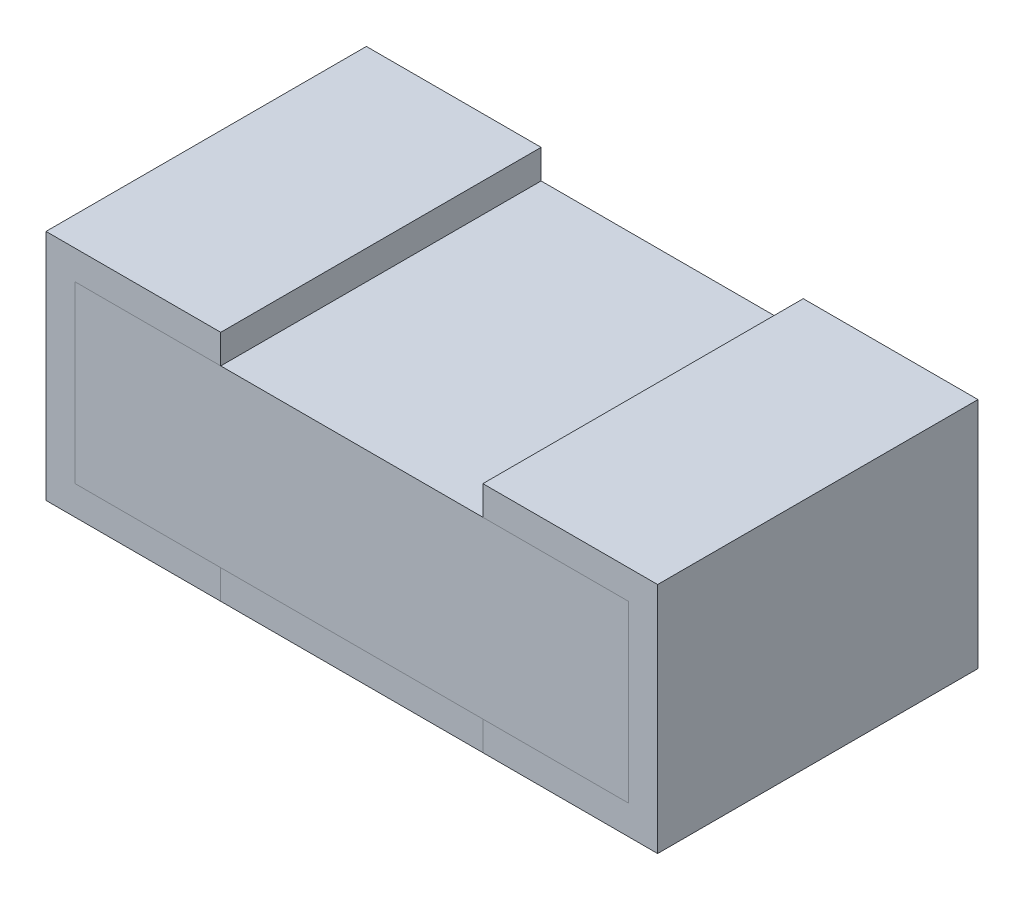
ISO-10303-21;
HEADER;
FILE_DESCRIPTION(('STEP AP214'),'2;1');
FILE_NAME('part.step','',(''),(''),'','','');
FILE_SCHEMA(('AUTOMOTIVE_DESIGN { 1 0 10303 214 1 1 1 1 }'));
ENDSEC;
DATA;
#1=APPLICATION_CONTEXT('core data for automotive mechanical design processes');
#2=APPLICATION_PROTOCOL_DEFINITION('international standard','automotive_design',2000,#1);
#3=PRODUCT_CONTEXT('',#1,'mechanical');
#4=PRODUCT('Part','Part','',(#3));
#5=PRODUCT_RELATED_PRODUCT_CATEGORY('part','',(#4));
#6=PRODUCT_DEFINITION_FORMATION('','',#4);
#7=PRODUCT_DEFINITION_CONTEXT('part definition',#1,'design');
#8=PRODUCT_DEFINITION('design','',#6,#7);
#9=PRODUCT_DEFINITION_SHAPE('','',#8);
#10=(LENGTH_UNIT() NAMED_UNIT(*) SI_UNIT(.MILLI.,.METRE.));
#11=(NAMED_UNIT(*) PLANE_ANGLE_UNIT() SI_UNIT($,.RADIAN.));
#12=(NAMED_UNIT(*) SI_UNIT($,.STERADIAN.) SOLID_ANGLE_UNIT());
#13=UNCERTAINTY_MEASURE_WITH_UNIT(LENGTH_MEASURE(1.E-05),#10,'distance_accuracy_value','');
#14=(GEOMETRIC_REPRESENTATION_CONTEXT(3) GLOBAL_UNCERTAINTY_ASSIGNED_CONTEXT((#13)) GLOBAL_UNIT_ASSIGNED_CONTEXT((#10,
#11,#12)) REPRESENTATION_CONTEXT('',''));
#15=CARTESIAN_POINT('',(0.,0.,0.));
#16=DIRECTION('',(0.,0.,1.));
#17=DIRECTION('',(1.,0.,0.));
#18=AXIS2_PLACEMENT_3D('',#15,#16,#17);
#19=CARTESIAN_POINT('',(0.999999999976395,0.35000000005278,0.));
#20=DIRECTION('',(1.,0.,0.));
#21=DIRECTION('',(0.,0.,-1.));
#22=AXIS2_PLACEMENT_3D('',#19,#20,#21);
#23=PLANE('',#22);
#24=DIRECTION('',(0.,1.,0.));
#25=VECTOR('',#24,1.);
#26=CARTESIAN_POINT('',(0.999999999976395,0.35000000005278,0.55));
#27=LINE('',#26,#25);
#28=CARTESIAN_POINT('',(0.999999999976395,0.049999999987449,0.55));
#29=VERTEX_POINT('',#28);
#30=CARTESIAN_POINT('',(0.999999999976395,0.35000000005278,0.55));
#31=VERTEX_POINT('',#30);
#32=EDGE_CURVE('E111',#29,#31,#27,.T.);
#33=ORIENTED_EDGE('',*,*,#32,.F.);
#34=DIRECTION('',(0.,0.,1.));
#35=VECTOR('',#34,1.);
#36=CARTESIAN_POINT('',(0.999999999976395,0.049999999987449,0.));
#37=LINE('',#36,#35);
#38=CARTESIAN_POINT('',(0.999999999976395,0.049999999987449,0.));
#39=VERTEX_POINT('',#38);
#40=EDGE_CURVE('E12',#39,#29,#37,.T.);
#41=ORIENTED_EDGE('',*,*,#40,.F.);
#42=DIRECTION('',(0.,1.,0.));
#43=VECTOR('',#42,1.);
#44=CARTESIAN_POINT('',(0.999999999976395,0.35000000005278,0.));
#45=LINE('',#44,#43);
#46=CARTESIAN_POINT('',(0.999999999976395,0.35000000005278,0.));
#47=VERTEX_POINT('',#46);
#48=EDGE_CURVE('E105',#39,#47,#45,.T.);
#49=ORIENTED_EDGE('',*,*,#48,.T.);
#50=DIRECTION('',(0.,0.,1.));
#51=VECTOR('',#50,1.);
#52=CARTESIAN_POINT('',(0.999999999976395,0.35000000005278,0.));
#53=LINE('',#52,#51);
#54=EDGE_CURVE('E50',#47,#31,#53,.T.);
#55=ORIENTED_EDGE('',*,*,#54,.T.);
#56=EDGE_LOOP('',(#33,#41,#49,#55));
#57=FACE_BOUND('',#56,.T.);
#58=ADVANCED_FACE('F47',(#57),#23,.T.);
#59=CARTESIAN_POINT('',(0.999999999976395,0.049999999987449,0.));
#60=DIRECTION('',(0.,-1.,0.));
#61=DIRECTION('',(0.,0.,-1.));
#62=AXIS2_PLACEMENT_3D('',#59,#60,#61);
#63=PLANE('',#62);
#64=DIRECTION('',(1.,0.,0.));
#65=VECTOR('',#64,1.);
#66=CARTESIAN_POINT('',(0.999999999976395,0.049999999987449,0.55));
#67=LINE('',#66,#65);
#68=CARTESIAN_POINT('',(0.0499999999873935,0.049999999987449,0.55));
#69=VERTEX_POINT('',#68);
#70=EDGE_CURVE('E107',#69,#29,#67,.T.);
#71=ORIENTED_EDGE('',*,*,#70,.F.);
#72=DIRECTION('',(0.,0.,1.));
#73=VECTOR('',#72,1.);
#74=CARTESIAN_POINT('',(0.0499999999873935,0.049999999987449,0.));
#75=LINE('',#74,#73);
#76=CARTESIAN_POINT('',(0.0499999999873935,0.049999999987449,0.));
#77=VERTEX_POINT('',#76);
#78=EDGE_CURVE('E56',#77,#69,#75,.T.);
#79=ORIENTED_EDGE('',*,*,#78,.F.);
#80=DIRECTION('',(1.,0.,0.));
#81=VECTOR('',#80,1.);
#82=CARTESIAN_POINT('',(0.999999999976395,0.049999999987449,0.));
#83=LINE('',#82,#81);
#84=EDGE_CURVE('E102',#77,#39,#83,.T.);
#85=ORIENTED_EDGE('',*,*,#84,.T.);
#86=ORIENTED_EDGE('',*,*,#40,.T.);
#87=EDGE_LOOP('',(#71,#79,#85,#86));
#88=FACE_BOUND('',#87,.T.);
#89=ADVANCED_FACE('F121',(#88),#63,.T.);
#90=CARTESIAN_POINT('',(0.0499999999873935,0.049999999987449,0.));
#91=DIRECTION('',(-1.,0.,0.));
#92=DIRECTION('',(0.,0.,1.));
#93=AXIS2_PLACEMENT_3D('',#90,#91,#92);
#94=PLANE('',#93);
#95=DIRECTION('',(0.,-1.,0.));
#96=VECTOR('',#95,1.);
#97=CARTESIAN_POINT('',(0.0499999999873935,0.049999999987449,0.55));
#98=LINE('',#97,#96);
#99=CARTESIAN_POINT('',(0.0499999999873935,0.350000000039305,0.55));
#100=VERTEX_POINT('',#99);
#101=EDGE_CURVE('E97',#100,#69,#98,.T.);
#102=ORIENTED_EDGE('',*,*,#101,.F.);
#103=DIRECTION('',(0.,0.,1.));
#104=VECTOR('',#103,1.);
#105=CARTESIAN_POINT('',(0.0499999999873935,0.350000000039305,0.));
#106=LINE('',#105,#104);
#107=CARTESIAN_POINT('',(0.0499999999873935,0.350000000039305,0.));
#108=VERTEX_POINT('',#107);
#109=EDGE_CURVE('E92',#108,#100,#106,.T.);
#110=ORIENTED_EDGE('',*,*,#109,.F.);
#111=DIRECTION('',(0.,-1.,0.));
#112=VECTOR('',#111,1.);
#113=CARTESIAN_POINT('',(0.0499999999873935,0.049999999987449,0.));
#114=LINE('',#113,#112);
#115=EDGE_CURVE('E95',#108,#77,#114,.T.);
#116=ORIENTED_EDGE('',*,*,#115,.T.);
#117=ORIENTED_EDGE('',*,*,#78,.T.);
#118=EDGE_LOOP('',(#102,#110,#116,#117));
#119=FACE_BOUND('',#118,.T.);
#120=ADVANCED_FACE('F94',(#119),#94,.T.);
#121=CARTESIAN_POINT('',(0.0499999999873935,0.350000000039305,0.));
#122=DIRECTION('',(-1.41845599595198E-11,1.,0.));
#123=DIRECTION('',(-1.,-1.41845599595198E-11,0.));
#124=AXIS2_PLACEMENT_3D('',#121,#122,#123);
#125=PLANE('',#124);
#126=DIRECTION('',(-1.,-1.41845599595198E-11,0.));
#127=VECTOR('',#126,1.);
#128=CARTESIAN_POINT('',(0.0499999999873935,0.350000000039305,0.55));
#129=LINE('',#128,#127);
#130=EDGE_CURVE('E114',#31,#100,#129,.T.);
#131=ORIENTED_EDGE('',*,*,#130,.F.);
#132=ORIENTED_EDGE('',*,*,#54,.F.);
#133=DIRECTION('',(-1.,-1.41845599595198E-11,0.));
#134=VECTOR('',#133,1.);
#135=CARTESIAN_POINT('',(0.0499999999873935,0.350000000039305,0.));
#136=LINE('',#135,#134);
#137=EDGE_CURVE('E101',#47,#108,#136,.T.);
#138=ORIENTED_EDGE('',*,*,#137,.T.);
#139=ORIENTED_EDGE('',*,*,#109,.T.);
#140=EDGE_LOOP('',(#131,#132,#138,#139));
#141=FACE_BOUND('',#140,.T.);
#142=ADVANCED_FACE('F104',(#141),#125,.T.);
#143=CARTESIAN_POINT('',(0.,0.,0.));
#144=DIRECTION('',(0.,0.,-1.));
#145=DIRECTION('',(-1.,0.,0.));
#146=AXIS2_PLACEMENT_3D('',#143,#144,#145);
#147=PLANE('',#146);
#148=ORIENTED_EDGE('',*,*,#48,.F.);
#149=ORIENTED_EDGE('',*,*,#84,.F.);
#150=ORIENTED_EDGE('',*,*,#115,.F.);
#151=ORIENTED_EDGE('',*,*,#137,.F.);
#152=EDGE_LOOP('',(#148,#149,#150,#151));
#153=FACE_BOUND('',#152,.T.);
#154=ADVANCED_FACE('F100',(#153),#147,.T.);
#155=CARTESIAN_POINT('',(0.,0.,0.55));
#156=DIRECTION('',(0.,0.,-1.));
#157=DIRECTION('',(-1.,0.,0.));
#158=AXIS2_PLACEMENT_3D('',#155,#156,#157);
#159=PLANE('',#158);
#160=ORIENTED_EDGE('',*,*,#32,.T.);
#161=ORIENTED_EDGE('',*,*,#130,.T.);
#162=ORIENTED_EDGE('',*,*,#101,.T.);
#163=ORIENTED_EDGE('',*,*,#70,.T.);
#164=EDGE_LOOP('',(#160,#161,#162,#163));
#165=FACE_BOUND('',#164,.T.);
#166=ADVANCED_FACE('F120',(#165),#159,.F.);
#167=CLOSED_SHELL('',(#58,#89,#120,#142,#154,#166));
#168=MANIFOLD_SOLID_BREP('B2',#167);
#169=CARTESIAN_POINT('',(0.749999999982299,0.049999999987449,0.));
#170=DIRECTION('',(1.,0.,0.));
#171=DIRECTION('',(0.,0.,-1.));
#172=AXIS2_PLACEMENT_3D('',#169,#170,#171);
#173=PLANE('',#172);
#174=DIRECTION('',(0.,1.,0.));
#175=VECTOR('',#174,1.);
#176=CARTESIAN_POINT('',(0.749999999982299,0.049999999987449,0.55));
#177=LINE('',#176,#175);
#178=CARTESIAN_POINT('',(0.749999999982299,0.,0.55));
#179=VERTEX_POINT('',#178);
#180=CARTESIAN_POINT('',(0.749999999982299,0.049999999987449,0.55));
#181=VERTEX_POINT('',#180);
#182=EDGE_CURVE('E244',#179,#181,#177,.T.);
#183=ORIENTED_EDGE('',*,*,#182,.F.);
#184=DIRECTION('',(0.,0.,1.));
#185=VECTOR('',#184,1.);
#186=CARTESIAN_POINT('',(0.749999999982299,0.,0.));
#187=LINE('',#186,#185);
#188=CARTESIAN_POINT('',(0.749999999982299,0.,0.));
#189=VERTEX_POINT('',#188);
#190=EDGE_CURVE('E45',#189,#179,#187,.T.);
#191=ORIENTED_EDGE('',*,*,#190,.F.);
#192=DIRECTION('',(0.,1.,0.));
#193=VECTOR('',#192,1.);
#194=CARTESIAN_POINT('',(0.749999999982299,0.049999999987449,0.));
#195=LINE('',#194,#193);
#196=CARTESIAN_POINT('',(0.749999999982299,0.049999999987449,0.));
#197=VERTEX_POINT('',#196);
#198=EDGE_CURVE('E238',#189,#197,#195,.T.);
#199=ORIENTED_EDGE('',*,*,#198,.T.);
#200=DIRECTION('',(0.,0.,1.));
#201=VECTOR('',#200,1.);
#202=CARTESIAN_POINT('',(0.749999999982299,0.049999999987449,0.));
#203=LINE('',#202,#201);
#204=EDGE_CURVE('E183',#197,#181,#203,.T.);
#205=ORIENTED_EDGE('',*,*,#204,.T.);
#206=EDGE_LOOP('',(#183,#191,#199,#205));
#207=FACE_BOUND('',#206,.T.);
#208=ADVANCED_FACE('F180',(#207),#173,.T.);
#209=CARTESIAN_POINT('',(0.749999999982299,0.,0.));
#210=DIRECTION('',(0.,-1.,0.));
#211=DIRECTION('',(0.,0.,-1.));
#212=AXIS2_PLACEMENT_3D('',#209,#210,#211);
#213=PLANE('',#212);
#214=DIRECTION('',(1.,0.,0.));
#215=VECTOR('',#214,1.);
#216=CARTESIAN_POINT('',(0.749999999982299,0.,0.55));
#217=LINE('',#216,#215);
#218=CARTESIAN_POINT('',(0.299999999981496,0.,0.55));
#219=VERTEX_POINT('',#218);
#220=EDGE_CURVE('E240',#219,#179,#217,.T.);
#221=ORIENTED_EDGE('',*,*,#220,.F.);
#222=DIRECTION('',(0.,0.,1.));
#223=VECTOR('',#222,1.);
#224=CARTESIAN_POINT('',(0.299999999981496,0.,0.));
#225=LINE('',#224,#223);
#226=CARTESIAN_POINT('',(0.299999999981496,0.,0.));
#227=VERTEX_POINT('',#226);
#228=EDGE_CURVE('E189',#227,#219,#225,.T.);
#229=ORIENTED_EDGE('',*,*,#228,.F.);
#230=DIRECTION('',(1.,0.,0.));
#231=VECTOR('',#230,1.);
#232=CARTESIAN_POINT('',(0.749999999982299,0.,0.));
#233=LINE('',#232,#231);
#234=EDGE_CURVE('E235',#227,#189,#233,.T.);
#235=ORIENTED_EDGE('',*,*,#234,.T.);
#236=ORIENTED_EDGE('',*,*,#190,.T.);
#237=EDGE_LOOP('',(#221,#229,#235,#236));
#238=FACE_BOUND('',#237,.T.);
#239=ADVANCED_FACE('F254',(#238),#213,.T.);
#240=CARTESIAN_POINT('',(0.299999999981496,0.,0.));
#241=DIRECTION('',(-1.,0.,0.));
#242=DIRECTION('',(0.,0.,1.));
#243=AXIS2_PLACEMENT_3D('',#240,#241,#242);
#244=PLANE('',#243);
#245=DIRECTION('',(0.,-1.,0.));
#246=VECTOR('',#245,1.);
#247=CARTESIAN_POINT('',(0.299999999981496,0.,0.55));
#248=LINE('',#247,#246);
#249=CARTESIAN_POINT('',(0.299999999981496,0.049999999987449,0.55));
#250=VERTEX_POINT('',#249);
#251=EDGE_CURVE('E230',#250,#219,#248,.T.);
#252=ORIENTED_EDGE('',*,*,#251,.F.);
#253=DIRECTION('',(0.,0.,1.));
#254=VECTOR('',#253,1.);
#255=CARTESIAN_POINT('',(0.299999999981496,0.049999999987449,0.));
#256=LINE('',#255,#254);
#257=CARTESIAN_POINT('',(0.299999999981496,0.049999999987449,0.));
#258=VERTEX_POINT('',#257);
#259=EDGE_CURVE('E225',#258,#250,#256,.T.);
#260=ORIENTED_EDGE('',*,*,#259,.F.);
#261=DIRECTION('',(0.,-1.,0.));
#262=VECTOR('',#261,1.);
#263=CARTESIAN_POINT('',(0.299999999981496,0.,0.));
#264=LINE('',#263,#262);
#265=EDGE_CURVE('E228',#258,#227,#264,.T.);
#266=ORIENTED_EDGE('',*,*,#265,.T.);
#267=ORIENTED_EDGE('',*,*,#228,.T.);
#268=EDGE_LOOP('',(#252,#260,#266,#267));
#269=FACE_BOUND('',#268,.T.);
#270=ADVANCED_FACE('F227',(#269),#244,.T.);
#271=CARTESIAN_POINT('',(0.299999999981496,0.049999999987449,0.));
#272=DIRECTION('',(0.,1.,0.));
#273=DIRECTION('',(0.,0.,1.));
#274=AXIS2_PLACEMENT_3D('',#271,#272,#273);
#275=PLANE('',#274);
#276=DIRECTION('',(-1.,0.,0.));
#277=VECTOR('',#276,1.);
#278=CARTESIAN_POINT('',(0.299999999981496,0.049999999987449,0.55));
#279=LINE('',#278,#277);
#280=EDGE_CURVE('E247',#181,#250,#279,.T.);
#281=ORIENTED_EDGE('',*,*,#280,.F.);
#282=ORIENTED_EDGE('',*,*,#204,.F.);
#283=DIRECTION('',(-1.,0.,0.));
#284=VECTOR('',#283,1.);
#285=CARTESIAN_POINT('',(0.299999999981496,0.049999999987449,0.));
#286=LINE('',#285,#284);
#287=EDGE_CURVE('E234',#197,#258,#286,.T.);
#288=ORIENTED_EDGE('',*,*,#287,.T.);
#289=ORIENTED_EDGE('',*,*,#259,.T.);
#290=EDGE_LOOP('',(#281,#282,#288,#289));
#291=FACE_BOUND('',#290,.T.);
#292=ADVANCED_FACE('F237',(#291),#275,.T.);
#293=CARTESIAN_POINT('',(0.,0.,0.));
#294=DIRECTION('',(0.,0.,-1.));
#295=DIRECTION('',(-1.,0.,0.));
#296=AXIS2_PLACEMENT_3D('',#293,#294,#295);
#297=PLANE('',#296);
#298=ORIENTED_EDGE('',*,*,#198,.F.);
#299=ORIENTED_EDGE('',*,*,#234,.F.);
#300=ORIENTED_EDGE('',*,*,#265,.F.);
#301=ORIENTED_EDGE('',*,*,#287,.F.);
#302=EDGE_LOOP('',(#298,#299,#300,#301));
#303=FACE_BOUND('',#302,.T.);
#304=ADVANCED_FACE('F233',(#303),#297,.T.);
#305=CARTESIAN_POINT('',(0.,0.,0.55));
#306=DIRECTION('',(0.,0.,-1.));
#307=DIRECTION('',(-1.,0.,0.));
#308=AXIS2_PLACEMENT_3D('',#305,#306,#307);
#309=PLANE('',#308);
#310=ORIENTED_EDGE('',*,*,#182,.T.);
#311=ORIENTED_EDGE('',*,*,#280,.T.);
#312=ORIENTED_EDGE('',*,*,#251,.T.);
#313=ORIENTED_EDGE('',*,*,#220,.T.);
#314=EDGE_LOOP('',(#310,#311,#312,#313));
#315=FACE_BOUND('',#314,.T.);
#316=ADVANCED_FACE('F253',(#315),#309,.F.);
#317=CLOSED_SHELL('',(#208,#239,#270,#292,#304,#316));
#318=MANIFOLD_SOLID_BREP('B6',#317);
#319=CARTESIAN_POINT('',(0.749999999982299,0.400000000040229,0.55));
#320=DIRECTION('',(1.,0.,0.));
#321=DIRECTION('',(0.,0.,-1.));
#322=AXIS2_PLACEMENT_3D('',#319,#320,#321);
#323=PLANE('',#322);
#324=DIRECTION('',(0.,-1.,0.));
#325=VECTOR('',#324,1.);
#326=CARTESIAN_POINT('',(0.749999999982299,0.400000000040229,0.));
#327=LINE('',#326,#325);
#328=CARTESIAN_POINT('',(0.749999999982299,0.400000000040229,0.));
#329=VERTEX_POINT('',#328);
#330=CARTESIAN_POINT('',(0.749999999982299,0.35000000005278,0.));
#331=VERTEX_POINT('',#330);
#332=EDGE_CURVE('E408',#329,#331,#327,.T.);
#333=ORIENTED_EDGE('',*,*,#332,.T.);
#334=DIRECTION('',(0.,0.,-1.));
#335=VECTOR('',#334,1.);
#336=CARTESIAN_POINT('',(0.749999999982299,0.35000000005278,0.55));
#337=LINE('',#336,#335);
#338=CARTESIAN_POINT('',(0.749999999982299,0.35000000005278,0.55));
#339=VERTEX_POINT('',#338);
#340=EDGE_CURVE('E178',#339,#331,#337,.T.);
#341=ORIENTED_EDGE('',*,*,#340,.F.);
#342=DIRECTION('',(0.,-1.,0.));
#343=VECTOR('',#342,1.);
#344=CARTESIAN_POINT('',(0.749999999982299,0.400000000040229,0.55));
#345=LINE('',#344,#343);
#346=CARTESIAN_POINT('',(0.749999999982299,0.400000000040229,0.55));
#347=VERTEX_POINT('',#346);
#348=EDGE_CURVE('E422',#347,#339,#345,.T.);
#349=ORIENTED_EDGE('',*,*,#348,.F.);
#350=DIRECTION('',(0.,0.,-1.));
#351=VECTOR('',#350,1.);
#352=CARTESIAN_POINT('',(0.749999999982299,0.400000000040229,0.55));
#353=LINE('',#352,#351);
#354=EDGE_CURVE('E404',#347,#329,#353,.T.);
#355=ORIENTED_EDGE('',*,*,#354,.T.);
#356=EDGE_LOOP('',(#333,#341,#349,#355));
#357=FACE_BOUND('',#356,.T.);
#358=ADVANCED_FACE('F312',(#357),#323,.F.);
#359=CARTESIAN_POINT('',(0.749999999982299,0.35000000005278,0.55));
#360=DIRECTION('',(0.,1.,0.));
#361=DIRECTION('',(0.,0.,1.));
#362=AXIS2_PLACEMENT_3D('',#359,#360,#361);
#363=PLANE('',#362);
#364=DIRECTION('',(1.,0.,0.));
#365=VECTOR('',#364,1.);
#366=CARTESIAN_POINT('',(0.749999999982299,0.35000000005278,0.));
#367=LINE('',#366,#365);
#368=CARTESIAN_POINT('',(0.999999999976395,0.35000000005278,0.));
#369=VERTEX_POINT('',#368);
#370=EDGE_CURVE('E411',#331,#369,#367,.T.);
#371=ORIENTED_EDGE('',*,*,#370,.T.);
#372=DIRECTION('',(0.,0.,-1.));
#373=VECTOR('',#372,1.);
#374=CARTESIAN_POINT('',(0.999999999976395,0.35000000005278,0.55));
#375=LINE('',#374,#373);
#376=CARTESIAN_POINT('',(0.999999999976395,0.35000000005278,0.55));
#377=VERTEX_POINT('',#376);
#378=EDGE_CURVE('E320',#377,#369,#375,.T.);
#379=ORIENTED_EDGE('',*,*,#378,.F.);
#380=DIRECTION('',(1.,0.,0.));
#381=VECTOR('',#380,1.);
#382=CARTESIAN_POINT('',(0.749999999982299,0.35000000005278,0.55));
#383=LINE('',#382,#381);
#384=EDGE_CURVE('E371',#339,#377,#383,.T.);
#385=ORIENTED_EDGE('',*,*,#384,.F.);
#386=ORIENTED_EDGE('',*,*,#340,.T.);
#387=EDGE_LOOP('',(#371,#379,#385,#386));
#388=FACE_BOUND('',#387,.T.);
#389=ADVANCED_FACE('F457',(#388),#363,.F.);
#390=CARTESIAN_POINT('',(0.999999999976395,0.35000000005278,0.55));
#391=DIRECTION('',(1.,0.,0.));
#392=DIRECTION('',(0.,0.,-1.));
#393=AXIS2_PLACEMENT_3D('',#390,#391,#392);
#394=PLANE('',#393);
#395=DIRECTION('',(0.,-1.,0.));
#396=VECTOR('',#395,1.);
#397=CARTESIAN_POINT('',(0.999999999976395,0.35000000005278,0.));
#398=LINE('',#397,#396);
#399=CARTESIAN_POINT('',(0.999999999976395,0.049999999987449,0.));
#400=VERTEX_POINT('',#399);
#401=EDGE_CURVE('E413',#369,#400,#398,.T.);
#402=ORIENTED_EDGE('',*,*,#401,.T.);
#403=DIRECTION('',(0.,0.,-1.));
#404=VECTOR('',#403,1.);
#405=CARTESIAN_POINT('',(0.999999999976395,0.049999999987449,0.55));
#406=LINE('',#405,#404);
#407=CARTESIAN_POINT('',(0.999999999976395,0.049999999987449,0.55));
#408=VERTEX_POINT('',#407);
#409=EDGE_CURVE('E429',#408,#400,#406,.T.);
#410=ORIENTED_EDGE('',*,*,#409,.F.);
#411=DIRECTION('',(0.,-1.,0.));
#412=VECTOR('',#411,1.);
#413=CARTESIAN_POINT('',(0.999999999976395,0.35000000005278,0.55));
#414=LINE('',#413,#412);
#415=EDGE_CURVE('E437',#377,#408,#414,.T.);
#416=ORIENTED_EDGE('',*,*,#415,.F.);
#417=ORIENTED_EDGE('',*,*,#378,.T.);
#418=EDGE_LOOP('',(#402,#410,#416,#417));
#419=FACE_BOUND('',#418,.T.);
#420=ADVANCED_FACE('F435',(#419),#394,.F.);
#421=CARTESIAN_POINT('',(0.999999999976395,0.049999999987449,0.55));
#422=DIRECTION('',(0.,-1.,0.));
#423=DIRECTION('',(0.,0.,-1.));
#424=AXIS2_PLACEMENT_3D('',#421,#422,#423);
#425=PLANE('',#424);
#426=DIRECTION('',(-1.,0.,0.));
#427=VECTOR('',#426,1.);
#428=CARTESIAN_POINT('',(0.999999999976395,0.049999999987449,0.));
#429=LINE('',#428,#427);
#430=CARTESIAN_POINT('',(0.749999999982299,0.049999999987449,0.));
#431=VERTEX_POINT('',#430);
#432=EDGE_CURVE('E415',#400,#431,#429,.T.);
#433=ORIENTED_EDGE('',*,*,#432,.T.);
#434=DIRECTION('',(0.,0.,-1.));
#435=VECTOR('',#434,1.);
#436=CARTESIAN_POINT('',(0.749999999982299,0.049999999987449,0.55));
#437=LINE('',#436,#435);
#438=CARTESIAN_POINT('',(0.749999999982299,0.049999999987449,0.55));
#439=VERTEX_POINT('',#438);
#440=EDGE_CURVE('E426',#439,#431,#437,.T.);
#441=ORIENTED_EDGE('',*,*,#440,.F.);
#442=DIRECTION('',(-1.,0.,0.));
#443=VECTOR('',#442,1.);
#444=CARTESIAN_POINT('',(0.999999999976395,0.049999999987449,0.55));
#445=LINE('',#444,#443);
#446=EDGE_CURVE('E449',#408,#439,#445,.T.);
#447=ORIENTED_EDGE('',*,*,#446,.F.);
#448=ORIENTED_EDGE('',*,*,#409,.T.);
#449=EDGE_LOOP('',(#433,#441,#447,#448));
#450=FACE_BOUND('',#449,.T.);
#451=ADVANCED_FACE('F445',(#450),#425,.F.);
#452=CARTESIAN_POINT('',(0.749999999982299,0.049999999987449,0.55));
#453=DIRECTION('',(1.,0.,0.));
#454=DIRECTION('',(0.,0.,-1.));
#455=AXIS2_PLACEMENT_3D('',#452,#453,#454);
#456=PLANE('',#455);
#457=DIRECTION('',(0.,-1.,0.));
#458=VECTOR('',#457,1.);
#459=CARTESIAN_POINT('',(0.749999999982299,0.049999999987449,0.));
#460=LINE('',#459,#458);
#461=CARTESIAN_POINT('',(0.749999999982299,0.,0.));
#462=VERTEX_POINT('',#461);
#463=EDGE_CURVE('E417',#431,#462,#460,.T.);
#464=ORIENTED_EDGE('',*,*,#463,.T.);
#465=DIRECTION('',(0.,0.,-1.));
#466=VECTOR('',#465,1.);
#467=CARTESIAN_POINT('',(0.749999999982299,0.,0.55));
#468=LINE('',#467,#466);
#469=CARTESIAN_POINT('',(0.749999999982299,0.,0.55));
#470=VERTEX_POINT('',#469);
#471=EDGE_CURVE('E399',#470,#462,#468,.T.);
#472=ORIENTED_EDGE('',*,*,#471,.F.);
#473=DIRECTION('',(0.,-1.,0.));
#474=VECTOR('',#473,1.);
#475=CARTESIAN_POINT('',(0.749999999982299,0.049999999987449,0.55));
#476=LINE('',#475,#474);
#477=EDGE_CURVE('E390',#439,#470,#476,.T.);
#478=ORIENTED_EDGE('',*,*,#477,.F.);
#479=ORIENTED_EDGE('',*,*,#440,.T.);
#480=EDGE_LOOP('',(#464,#472,#478,#479));
#481=FACE_BOUND('',#480,.T.);
#482=ADVANCED_FACE('F448',(#481),#456,.F.);
#483=CARTESIAN_POINT('',(0.749999999982299,0.,0.55));
#484=DIRECTION('',(0.,1.,0.));
#485=DIRECTION('',(0.,0.,1.));
#486=AXIS2_PLACEMENT_3D('',#483,#484,#485);
#487=PLANE('',#486);
#488=DIRECTION('',(1.,0.,0.));
#489=VECTOR('',#488,1.);
#490=CARTESIAN_POINT('',(0.749999999982299,0.,0.));
#491=LINE('',#490,#489);
#492=CARTESIAN_POINT('',(1.0499999999638,0.,0.));
#493=VERTEX_POINT('',#492);
#494=EDGE_CURVE('E398',#462,#493,#491,.T.);
#495=ORIENTED_EDGE('',*,*,#494,.T.);
#496=DIRECTION('',(0.,0.,-1.));
#497=VECTOR('',#496,1.);
#498=CARTESIAN_POINT('',(1.0499999999638,0.,0.55));
#499=LINE('',#498,#497);
#500=CARTESIAN_POINT('',(1.0499999999638,0.,0.55));
#501=VERTEX_POINT('',#500);
#502=EDGE_CURVE('E395',#501,#493,#499,.T.);
#503=ORIENTED_EDGE('',*,*,#502,.F.);
#504=DIRECTION('',(1.,0.,0.));
#505=VECTOR('',#504,1.);
#506=CARTESIAN_POINT('',(0.749999999982299,0.,0.55));
#507=LINE('',#506,#505);
#508=EDGE_CURVE('E384',#470,#501,#507,.T.);
#509=ORIENTED_EDGE('',*,*,#508,.F.);
#510=ORIENTED_EDGE('',*,*,#471,.T.);
#511=EDGE_LOOP('',(#495,#503,#509,#510));
#512=FACE_BOUND('',#511,.T.);
#513=ADVANCED_FACE('F396',(#512),#487,.F.);
#514=CARTESIAN_POINT('',(1.0499999999638,0.,0.55));
#515=DIRECTION('',(-1.,0.,0.));
#516=DIRECTION('',(0.,0.,1.));
#517=AXIS2_PLACEMENT_3D('',#514,#515,#516);
#518=PLANE('',#517);
#519=DIRECTION('',(0.,1.,0.));
#520=VECTOR('',#519,1.);
#521=CARTESIAN_POINT('',(1.0499999999638,0.,0.));
#522=LINE('',#521,#520);
#523=CARTESIAN_POINT('',(1.0499999999638,0.400000000040229,0.));
#524=VERTEX_POINT('',#523);
#525=EDGE_CURVE('E357',#493,#524,#522,.T.);
#526=ORIENTED_EDGE('',*,*,#525,.T.);
#527=DIRECTION('',(0.,0.,-1.));
#528=VECTOR('',#527,1.);
#529=CARTESIAN_POINT('',(1.0499999999638,0.400000000040229,0.55));
#530=LINE('',#529,#528);
#531=CARTESIAN_POINT('',(1.0499999999638,0.400000000040229,0.55));
#532=VERTEX_POINT('',#531);
#533=EDGE_CURVE('E400',#532,#524,#530,.T.);
#534=ORIENTED_EDGE('',*,*,#533,.F.);
#535=DIRECTION('',(0.,1.,0.));
#536=VECTOR('',#535,1.);
#537=CARTESIAN_POINT('',(1.0499999999638,0.,0.55));
#538=LINE('',#537,#536);
#539=EDGE_CURVE('E388',#501,#532,#538,.T.);
#540=ORIENTED_EDGE('',*,*,#539,.F.);
#541=ORIENTED_EDGE('',*,*,#502,.T.);
#542=EDGE_LOOP('',(#526,#534,#540,#541));
#543=FACE_BOUND('',#542,.T.);
#544=ADVANCED_FACE('F402',(#543),#518,.F.);
#545=CARTESIAN_POINT('',(1.0499999999638,0.400000000040229,0.55));
#546=DIRECTION('',(0.,-1.,0.));
#547=DIRECTION('',(0.,0.,-1.));
#548=AXIS2_PLACEMENT_3D('',#545,#546,#547);
#549=PLANE('',#548);
#550=DIRECTION('',(-1.,0.,0.));
#551=VECTOR('',#550,1.);
#552=CARTESIAN_POINT('',(1.0499999999638,0.400000000040229,0.));
#553=LINE('',#552,#551);
#554=EDGE_CURVE('E363',#524,#329,#553,.T.);
#555=ORIENTED_EDGE('',*,*,#554,.T.);
#556=ORIENTED_EDGE('',*,*,#354,.F.);
#557=DIRECTION('',(-1.,0.,0.));
#558=VECTOR('',#557,1.);
#559=CARTESIAN_POINT('',(1.0499999999638,0.400000000040229,0.55));
#560=LINE('',#559,#558);
#561=EDGE_CURVE('E328',#532,#347,#560,.T.);
#562=ORIENTED_EDGE('',*,*,#561,.F.);
#563=ORIENTED_EDGE('',*,*,#533,.T.);
#564=EDGE_LOOP('',(#555,#556,#562,#563));
#565=FACE_BOUND('',#564,.T.);
#566=ADVANCED_FACE('F473',(#565),#549,.F.);
#567=CARTESIAN_POINT('',(0.,0.,0.55));
#568=DIRECTION('',(0.,0.,1.));
#569=DIRECTION('',(1.,0.,0.));
#570=AXIS2_PLACEMENT_3D('',#567,#568,#569);
#571=PLANE('',#570);
#572=ORIENTED_EDGE('',*,*,#348,.T.);
#573=ORIENTED_EDGE('',*,*,#384,.T.);
#574=ORIENTED_EDGE('',*,*,#415,.T.);
#575=ORIENTED_EDGE('',*,*,#446,.T.);
#576=ORIENTED_EDGE('',*,*,#477,.T.);
#577=ORIENTED_EDGE('',*,*,#508,.T.);
#578=ORIENTED_EDGE('',*,*,#539,.T.);
#579=ORIENTED_EDGE('',*,*,#561,.T.);
#580=EDGE_LOOP('',(#572,#573,#574,#575,#576,#577,#578,#579));
#581=FACE_BOUND('',#580,.T.);
#582=ADVANCED_FACE('F386',(#581),#571,.T.);
#583=CARTESIAN_POINT('',(0.,0.,0.));
#584=DIRECTION('',(0.,0.,1.));
#585=DIRECTION('',(1.,0.,0.));
#586=AXIS2_PLACEMENT_3D('',#583,#584,#585);
#587=PLANE('',#586);
#588=ORIENTED_EDGE('',*,*,#332,.F.);
#589=ORIENTED_EDGE('',*,*,#554,.F.);
#590=ORIENTED_EDGE('',*,*,#525,.F.);
#591=ORIENTED_EDGE('',*,*,#494,.F.);
#592=ORIENTED_EDGE('',*,*,#463,.F.);
#593=ORIENTED_EDGE('',*,*,#432,.F.);
#594=ORIENTED_EDGE('',*,*,#401,.F.);
#595=ORIENTED_EDGE('',*,*,#370,.F.);
#596=EDGE_LOOP('',(#588,#589,#590,#591,#592,#593,#594,#595));
#597=FACE_BOUND('',#596,.T.);
#598=ADVANCED_FACE('F441',(#597),#587,.F.);
#599=CLOSED_SHELL('',(#358,#389,#420,#451,#482,#513,#544,#566,#582,#598));
#600=MANIFOLD_SOLID_BREP('B39',#599);
#601=CARTESIAN_POINT('',(0.299999999981496,0.,0.55));
#602=DIRECTION('',(-1.,0.,0.));
#603=DIRECTION('',(0.,0.,1.));
#604=AXIS2_PLACEMENT_3D('',#601,#602,#603);
#605=PLANE('',#604);
#606=DIRECTION('',(0.,1.,0.));
#607=VECTOR('',#606,1.);
#608=CARTESIAN_POINT('',(0.299999999981496,0.,0.));
#609=LINE('',#608,#607);
#610=CARTESIAN_POINT('',(0.299999999981496,0.,0.));
#611=VERTEX_POINT('',#610);
#612=CARTESIAN_POINT('',(0.299999999981496,0.049999999987449,0.));
#613=VERTEX_POINT('',#612);
#614=EDGE_CURVE('E635',#611,#613,#609,.T.);
#615=ORIENTED_EDGE('',*,*,#614,.T.);
#616=DIRECTION('',(0.,0.,-1.));
#617=VECTOR('',#616,1.);
#618=CARTESIAN_POINT('',(0.299999999981496,0.049999999987449,0.55));
#619=LINE('',#618,#617);
#620=CARTESIAN_POINT('',(0.299999999981496,0.049999999987449,0.55));
#621=VERTEX_POINT('',#620);
#622=EDGE_CURVE('E310',#621,#613,#619,.T.);
#623=ORIENTED_EDGE('',*,*,#622,.F.);
#624=DIRECTION('',(0.,1.,0.));
#625=VECTOR('',#624,1.);
#626=CARTESIAN_POINT('',(0.299999999981496,0.,0.55));
#627=LINE('',#626,#625);
#628=CARTESIAN_POINT('',(0.299999999981496,0.,0.55));
#629=VERTEX_POINT('',#628);
#630=EDGE_CURVE('E649',#629,#621,#627,.T.);
#631=ORIENTED_EDGE('',*,*,#630,.F.);
#632=DIRECTION('',(0.,0.,-1.));
#633=VECTOR('',#632,1.);
#634=CARTESIAN_POINT('',(0.299999999981496,0.,0.55));
#635=LINE('',#634,#633);
#636=EDGE_CURVE('E631',#629,#611,#635,.T.);
#637=ORIENTED_EDGE('',*,*,#636,.T.);
#638=EDGE_LOOP('',(#615,#623,#631,#637));
#639=FACE_BOUND('',#638,.T.);
#640=ADVANCED_FACE('F539',(#639),#605,.F.);
#641=CARTESIAN_POINT('',(0.299999999981496,0.049999999987449,0.55));
#642=DIRECTION('',(0.,-1.,0.));
#643=DIRECTION('',(0.,0.,-1.));
#644=AXIS2_PLACEMENT_3D('',#641,#642,#643);
#645=PLANE('',#644);
#646=DIRECTION('',(-1.,0.,0.));
#647=VECTOR('',#646,1.);
#648=CARTESIAN_POINT('',(0.299999999981496,0.049999999987449,0.));
#649=LINE('',#648,#647);
#650=CARTESIAN_POINT('',(0.0499999999873935,0.049999999987449,0.));
#651=VERTEX_POINT('',#650);
#652=EDGE_CURVE('E638',#613,#651,#649,.T.);
#653=ORIENTED_EDGE('',*,*,#652,.T.);
#654=DIRECTION('',(0.,0.,-1.));
#655=VECTOR('',#654,1.);
#656=CARTESIAN_POINT('',(0.0499999999873935,0.049999999987449,0.55));
#657=LINE('',#656,#655);
#658=CARTESIAN_POINT('',(0.0499999999873935,0.049999999987449,0.55));
#659=VERTEX_POINT('',#658);
#660=EDGE_CURVE('E547',#659,#651,#657,.T.);
#661=ORIENTED_EDGE('',*,*,#660,.F.);
#662=DIRECTION('',(-1.,0.,0.));
#663=VECTOR('',#662,1.);
#664=CARTESIAN_POINT('',(0.299999999981496,0.049999999987449,0.55));
#665=LINE('',#664,#663);
#666=EDGE_CURVE('E598',#621,#659,#665,.T.);
#667=ORIENTED_EDGE('',*,*,#666,.F.);
#668=ORIENTED_EDGE('',*,*,#622,.T.);
#669=EDGE_LOOP('',(#653,#661,#667,#668));
#670=FACE_BOUND('',#669,.T.);
#671=ADVANCED_FACE('F684',(#670),#645,.F.);
#672=CARTESIAN_POINT('',(0.0499999999873935,0.049999999987449,0.55));
#673=DIRECTION('',(-1.,0.,0.));
#674=DIRECTION('',(0.,0.,1.));
#675=AXIS2_PLACEMENT_3D('',#672,#673,#674);
#676=PLANE('',#675);
#677=DIRECTION('',(0.,1.,0.));
#678=VECTOR('',#677,1.);
#679=CARTESIAN_POINT('',(0.0499999999873935,0.049999999987449,0.));
#680=LINE('',#679,#678);
#681=CARTESIAN_POINT('',(0.0499999999873935,0.350000000039305,0.));
#682=VERTEX_POINT('',#681);
#683=EDGE_CURVE('E640',#651,#682,#680,.T.);
#684=ORIENTED_EDGE('',*,*,#683,.T.);
#685=DIRECTION('',(0.,0.,-1.));
#686=VECTOR('',#685,1.);
#687=CARTESIAN_POINT('',(0.0499999999873935,0.350000000039305,0.55));
#688=LINE('',#687,#686);
#689=CARTESIAN_POINT('',(0.0499999999873935,0.350000000039305,0.55));
#690=VERTEX_POINT('',#689);
#691=EDGE_CURVE('E656',#690,#682,#688,.T.);
#692=ORIENTED_EDGE('',*,*,#691,.F.);
#693=DIRECTION('',(0.,1.,0.));
#694=VECTOR('',#693,1.);
#695=CARTESIAN_POINT('',(0.0499999999873935,0.049999999987449,0.55));
#696=LINE('',#695,#694);
#697=EDGE_CURVE('E664',#659,#690,#696,.T.);
#698=ORIENTED_EDGE('',*,*,#697,.F.);
#699=ORIENTED_EDGE('',*,*,#660,.T.);
#700=EDGE_LOOP('',(#684,#692,#698,#699));
#701=FACE_BOUND('',#700,.T.);
#702=ADVANCED_FACE('F662',(#701),#676,.F.);
#703=CARTESIAN_POINT('',(0.0499999999873935,0.350000000039305,0.55));
#704=DIRECTION('',(0.,1.,0.));
#705=DIRECTION('',(0.,0.,1.));
#706=AXIS2_PLACEMENT_3D('',#703,#704,#705);
#707=PLANE('',#706);
#708=DIRECTION('',(1.,0.,0.));
#709=VECTOR('',#708,1.);
#710=CARTESIAN_POINT('',(0.0499999999873935,0.350000000039305,0.));
#711=LINE('',#710,#709);
#712=CARTESIAN_POINT('',(0.299999999981496,0.350000000039305,0.));
#713=VERTEX_POINT('',#712);
#714=EDGE_CURVE('E642',#682,#713,#711,.T.);
#715=ORIENTED_EDGE('',*,*,#714,.T.);
#716=DIRECTION('',(0.,0.,-1.));
#717=VECTOR('',#716,1.);
#718=CARTESIAN_POINT('',(0.299999999981496,0.350000000039305,0.55));
#719=LINE('',#718,#717);
#720=CARTESIAN_POINT('',(0.299999999981496,0.350000000039305,0.55));
#721=VERTEX_POINT('',#720);
#722=EDGE_CURVE('E653',#721,#713,#719,.T.);
#723=ORIENTED_EDGE('',*,*,#722,.F.);
#724=DIRECTION('',(1.,0.,0.));
#725=VECTOR('',#724,1.);
#726=CARTESIAN_POINT('',(0.0499999999873935,0.350000000039305,0.55));
#727=LINE('',#726,#725);
#728=EDGE_CURVE('E676',#690,#721,#727,.T.);
#729=ORIENTED_EDGE('',*,*,#728,.F.);
#730=ORIENTED_EDGE('',*,*,#691,.T.);
#731=EDGE_LOOP('',(#715,#723,#729,#730));
#732=FACE_BOUND('',#731,.T.);
#733=ADVANCED_FACE('F672',(#732),#707,.F.);
#734=CARTESIAN_POINT('',(0.299999999981496,0.350000000039305,0.55));
#735=DIRECTION('',(-1.,0.,0.));
#736=DIRECTION('',(0.,0.,1.));
#737=AXIS2_PLACEMENT_3D('',#734,#735,#736);
#738=PLANE('',#737);
#739=DIRECTION('',(0.,1.,0.));
#740=VECTOR('',#739,1.);
#741=CARTESIAN_POINT('',(0.299999999981496,0.350000000039305,0.));
#742=LINE('',#741,#740);
#743=CARTESIAN_POINT('',(0.299999999981496,0.400000000013279,0.));
#744=VERTEX_POINT('',#743);
#745=EDGE_CURVE('E644',#713,#744,#742,.T.);
#746=ORIENTED_EDGE('',*,*,#745,.T.);
#747=DIRECTION('',(0.,0.,-1.));
#748=VECTOR('',#747,1.);
#749=CARTESIAN_POINT('',(0.299999999981496,0.400000000013279,0.55));
#750=LINE('',#749,#748);
#751=CARTESIAN_POINT('',(0.299999999981496,0.400000000013279,0.55));
#752=VERTEX_POINT('',#751);
#753=EDGE_CURVE('E626',#752,#744,#750,.T.);
#754=ORIENTED_EDGE('',*,*,#753,.F.);
#755=DIRECTION('',(0.,1.,0.));
#756=VECTOR('',#755,1.);
#757=CARTESIAN_POINT('',(0.299999999981496,0.350000000039305,0.55));
#758=LINE('',#757,#756);
#759=EDGE_CURVE('E617',#721,#752,#758,.T.);
#760=ORIENTED_EDGE('',*,*,#759,.F.);
#761=ORIENTED_EDGE('',*,*,#722,.T.);
#762=EDGE_LOOP('',(#746,#754,#760,#761));
#763=FACE_BOUND('',#762,.T.);
#764=ADVANCED_FACE('F675',(#763),#738,.F.);
#765=CARTESIAN_POINT('',(0.299999999981496,0.400000000013279,0.55));
#766=DIRECTION('',(0.,-1.,0.));
#767=DIRECTION('',(0.,0.,-1.));
#768=AXIS2_PLACEMENT_3D('',#765,#766,#767);
#769=PLANE('',#768);
#770=DIRECTION('',(-1.,0.,0.));
#771=VECTOR('',#770,1.);
#772=CARTESIAN_POINT('',(0.299999999981496,0.400000000013279,0.));
#773=LINE('',#772,#771);
#774=CARTESIAN_POINT('',(0.,0.400000000013279,0.));
#775=VERTEX_POINT('',#774);
#776=EDGE_CURVE('E625',#744,#775,#773,.T.);
#777=ORIENTED_EDGE('',*,*,#776,.T.);
#778=DIRECTION('',(0.,0.,-1.));
#779=VECTOR('',#778,1.);
#780=CARTESIAN_POINT('',(0.,0.400000000013279,0.55));
#781=LINE('',#780,#779);
#782=CARTESIAN_POINT('',(0.,0.400000000013279,0.55));
#783=VERTEX_POINT('',#782);
#784=EDGE_CURVE('E622',#783,#775,#781,.T.);
#785=ORIENTED_EDGE('',*,*,#784,.F.);
#786=DIRECTION('',(-1.,0.,0.));
#787=VECTOR('',#786,1.);
#788=CARTESIAN_POINT('',(0.299999999981496,0.400000000013279,0.55));
#789=LINE('',#788,#787);
#790=EDGE_CURVE('E611',#752,#783,#789,.T.);
#791=ORIENTED_EDGE('',*,*,#790,.F.);
#792=ORIENTED_EDGE('',*,*,#753,.T.);
#793=EDGE_LOOP('',(#777,#785,#791,#792));
#794=FACE_BOUND('',#793,.T.);
#795=ADVANCED_FACE('F623',(#794),#769,.F.);
#796=CARTESIAN_POINT('',(0.,0.400000000013279,0.55));
#797=DIRECTION('',(1.,0.,0.));
#798=DIRECTION('',(0.,0.,-1.));
#799=AXIS2_PLACEMENT_3D('',#796,#797,#798);
#800=PLANE('',#799);
#801=DIRECTION('',(0.,-1.,0.));
#802=VECTOR('',#801,1.);
#803=CARTESIAN_POINT('',(0.,0.400000000013279,0.));
#804=LINE('',#803,#802);
#805=CARTESIAN_POINT('',(0.,0.,0.));
#806=VERTEX_POINT('',#805);
#807=EDGE_CURVE('E584',#775,#806,#804,.T.);
#808=ORIENTED_EDGE('',*,*,#807,.T.);
#809=DIRECTION('',(0.,0.,-1.));
#810=VECTOR('',#809,1.);
#811=CARTESIAN_POINT('',(0.,0.,0.55));
#812=LINE('',#811,#810);
#813=CARTESIAN_POINT('',(0.,0.,0.55));
#814=VERTEX_POINT('',#813);
#815=EDGE_CURVE('E627',#814,#806,#812,.T.);
#816=ORIENTED_EDGE('',*,*,#815,.F.);
#817=DIRECTION('',(0.,-1.,0.));
#818=VECTOR('',#817,1.);
#819=CARTESIAN_POINT('',(0.,0.400000000013279,0.55));
#820=LINE('',#819,#818);
#821=EDGE_CURVE('E615',#783,#814,#820,.T.);
#822=ORIENTED_EDGE('',*,*,#821,.F.);
#823=ORIENTED_EDGE('',*,*,#784,.T.);
#824=EDGE_LOOP('',(#808,#816,#822,#823));
#825=FACE_BOUND('',#824,.T.);
#826=ADVANCED_FACE('F629',(#825),#800,.F.);
#827=CARTESIAN_POINT('',(0.,0.,0.55));
#828=DIRECTION('',(0.,1.,0.));
#829=DIRECTION('',(0.,0.,1.));
#830=AXIS2_PLACEMENT_3D('',#827,#828,#829);
#831=PLANE('',#830);
#832=DIRECTION('',(1.,0.,0.));
#833=VECTOR('',#832,1.);
#834=CARTESIAN_POINT('',(0.,0.,0.));
#835=LINE('',#834,#833);
#836=EDGE_CURVE('E590',#806,#611,#835,.T.);
#837=ORIENTED_EDGE('',*,*,#836,.T.);
#838=ORIENTED_EDGE('',*,*,#636,.F.);
#839=DIRECTION('',(1.,0.,0.));
#840=VECTOR('',#839,1.);
#841=CARTESIAN_POINT('',(0.,0.,0.55));
#842=LINE('',#841,#840);
#843=EDGE_CURVE('E555',#814,#629,#842,.T.);
#844=ORIENTED_EDGE('',*,*,#843,.F.);
#845=ORIENTED_EDGE('',*,*,#815,.T.);
#846=EDGE_LOOP('',(#837,#838,#844,#845));
#847=FACE_BOUND('',#846,.T.);
#848=ADVANCED_FACE('F700',(#847),#831,.F.);
#849=CARTESIAN_POINT('',(0.,0.,0.55));
#850=DIRECTION('',(0.,0.,1.));
#851=DIRECTION('',(1.,0.,0.));
#852=AXIS2_PLACEMENT_3D('',#849,#850,#851);
#853=PLANE('',#852);
#854=ORIENTED_EDGE('',*,*,#630,.T.);
#855=ORIENTED_EDGE('',*,*,#666,.T.);
#856=ORIENTED_EDGE('',*,*,#697,.T.);
#857=ORIENTED_EDGE('',*,*,#728,.T.);
#858=ORIENTED_EDGE('',*,*,#759,.T.);
#859=ORIENTED_EDGE('',*,*,#790,.T.);
#860=ORIENTED_EDGE('',*,*,#821,.T.);
#861=ORIENTED_EDGE('',*,*,#843,.T.);
#862=EDGE_LOOP('',(#854,#855,#856,#857,#858,#859,#860,#861));
#863=FACE_BOUND('',#862,.T.);
#864=ADVANCED_FACE('F613',(#863),#853,.T.);
#865=CARTESIAN_POINT('',(0.,0.,0.));
#866=DIRECTION('',(0.,0.,1.));
#867=DIRECTION('',(1.,0.,0.));
#868=AXIS2_PLACEMENT_3D('',#865,#866,#867);
#869=PLANE('',#868);
#870=ORIENTED_EDGE('',*,*,#614,.F.);
#871=ORIENTED_EDGE('',*,*,#836,.F.);
#872=ORIENTED_EDGE('',*,*,#807,.F.);
#873=ORIENTED_EDGE('',*,*,#776,.F.);
#874=ORIENTED_EDGE('',*,*,#745,.F.);
#875=ORIENTED_EDGE('',*,*,#714,.F.);
#876=ORIENTED_EDGE('',*,*,#683,.F.);
#877=ORIENTED_EDGE('',*,*,#652,.F.);
#878=EDGE_LOOP('',(#870,#871,#872,#873,#874,#875,#876,#877));
#879=FACE_BOUND('',#878,.T.);
#880=ADVANCED_FACE('F668',(#879),#869,.F.);
#881=CLOSED_SHELL('',(#640,#671,#702,#733,#764,#795,#826,#848,#864,#880));
#882=MANIFOLD_SOLID_BREP('B172',#881);
#883=ADVANCED_BREP_SHAPE_REPRESENTATION('',(#18,#168,#318,#600,#882),#14);
#884=SHAPE_DEFINITION_REPRESENTATION(#9,#883);
ENDSEC;
END-ISO-10303-21;
